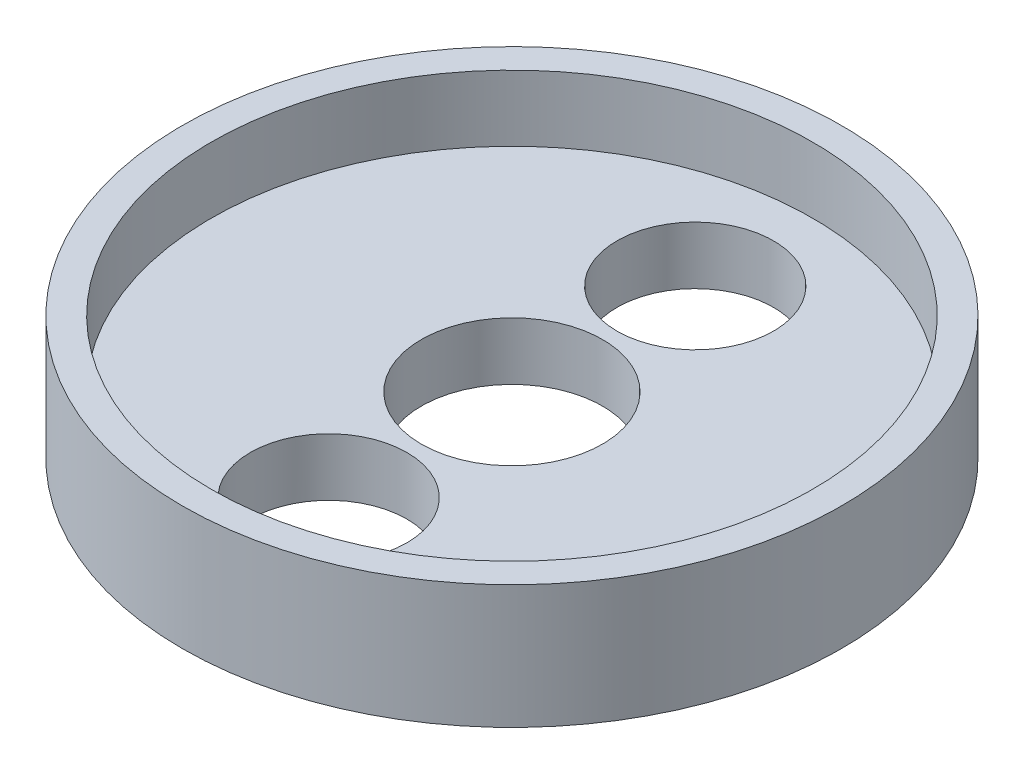
ISO-10303-21;
HEADER;
FILE_DESCRIPTION(('STEP AP214'),'2;1');
FILE_NAME('part.step','',(''),(''),'','','');
FILE_SCHEMA(('AUTOMOTIVE_DESIGN { 1 0 10303 214 1 1 1 1 }'));
ENDSEC;
DATA;
#1=APPLICATION_CONTEXT('core data for automotive mechanical design processes');
#2=APPLICATION_PROTOCOL_DEFINITION('international standard','automotive_design',2000,#1);
#3=PRODUCT_CONTEXT('',#1,'mechanical');
#4=PRODUCT('Part','Part','',(#3));
#5=PRODUCT_RELATED_PRODUCT_CATEGORY('part','',(#4));
#6=PRODUCT_DEFINITION_FORMATION('','',#4);
#7=PRODUCT_DEFINITION_CONTEXT('part definition',#1,'design');
#8=PRODUCT_DEFINITION('design','',#6,#7);
#9=PRODUCT_DEFINITION_SHAPE('','',#8);
#10=(LENGTH_UNIT() NAMED_UNIT(*) SI_UNIT(.MILLI.,.METRE.));
#11=(NAMED_UNIT(*) PLANE_ANGLE_UNIT() SI_UNIT($,.RADIAN.));
#12=(NAMED_UNIT(*) SI_UNIT($,.STERADIAN.) SOLID_ANGLE_UNIT());
#13=UNCERTAINTY_MEASURE_WITH_UNIT(LENGTH_MEASURE(1.E-05),#10,'distance_accuracy_value','');
#14=(GEOMETRIC_REPRESENTATION_CONTEXT(3) GLOBAL_UNCERTAINTY_ASSIGNED_CONTEXT((#13)) GLOBAL_UNIT_ASSIGNED_CONTEXT((#10,
#11,#12)) REPRESENTATION_CONTEXT('',''));
#15=CARTESIAN_POINT('',(0.,0.,0.));
#16=DIRECTION('',(0.,0.,1.));
#17=DIRECTION('',(1.,0.,0.));
#18=AXIS2_PLACEMENT_3D('',#15,#16,#17);
#19=CARTESIAN_POINT('',(0.,7.5,-11.125));
#20=DIRECTION('',(0.,-1.,0.));
#21=DIRECTION('',(0.,0.,-1.));
#22=AXIS2_PLACEMENT_3D('',#19,#20,#21);
#23=CYLINDRICAL_SURFACE('',#22,4.75);
#24=CARTESIAN_POINT('',(0.,0.,-11.125));
#25=DIRECTION('',(0.,1.,0.));
#26=DIRECTION('',(0.,0.,1.));
#27=AXIS2_PLACEMENT_3D('',#24,#25,#26);
#28=CIRCLE('',#27,4.75);
#29=CARTESIAN_POINT('',(0.,0.,-6.375));
#30=VERTEX_POINT('',#29);
#31=EDGE_CURVE('E58',#30,#30,#28,.T.);
#32=ORIENTED_EDGE('',*,*,#31,.F.);
#33=EDGE_LOOP('',(#32));
#34=FACE_BOUND('',#33,.T.);
#35=CARTESIAN_POINT('',(0.,3.5,-11.125));
#36=DIRECTION('',(0.,1.,0.));
#37=DIRECTION('',(0.,0.,1.));
#38=AXIS2_PLACEMENT_3D('',#35,#36,#37);
#39=CIRCLE('',#38,4.75);
#40=CARTESIAN_POINT('',(0.,3.5,-6.375));
#41=VERTEX_POINT('',#40);
#42=EDGE_CURVE('E71',#41,#41,#39,.T.);
#43=ORIENTED_EDGE('',*,*,#42,.T.);
#44=EDGE_LOOP('',(#43));
#45=FACE_BOUND('',#44,.T.);
#46=ADVANCED_FACE('F43',(#34,#45),#23,.F.);
#47=CARTESIAN_POINT('',(0.,7.5,0.));
#48=DIRECTION('',(0.,-1.,0.));
#49=DIRECTION('',(0.,0.,-1.));
#50=AXIS2_PLACEMENT_3D('',#47,#48,#49);
#51=CYLINDRICAL_SURFACE('',#50,5.5);
#52=CARTESIAN_POINT('',(0.,0.,0.));
#53=DIRECTION('',(0.,1.,0.));
#54=DIRECTION('',(0.,0.,1.));
#55=AXIS2_PLACEMENT_3D('',#52,#53,#54);
#56=CIRCLE('',#55,5.5);
#57=CARTESIAN_POINT('',(0.,0.,5.5));
#58=VERTEX_POINT('',#57);
#59=EDGE_CURVE('E63',#58,#58,#56,.T.);
#60=ORIENTED_EDGE('',*,*,#59,.F.);
#61=EDGE_LOOP('',(#60));
#62=FACE_BOUND('',#61,.T.);
#63=CARTESIAN_POINT('',(0.,3.5,0.));
#64=DIRECTION('',(0.,1.,0.));
#65=DIRECTION('',(0.,0.,1.));
#66=AXIS2_PLACEMENT_3D('',#63,#64,#65);
#67=CIRCLE('',#66,5.5);
#68=CARTESIAN_POINT('',(0.,3.5,5.5));
#69=VERTEX_POINT('',#68);
#70=EDGE_CURVE('E75',#69,#69,#67,.T.);
#71=ORIENTED_EDGE('',*,*,#70,.T.);
#72=EDGE_LOOP('',(#71));
#73=FACE_BOUND('',#72,.T.);
#74=ADVANCED_FACE('F107',(#62,#73),#51,.F.);
#75=CARTESIAN_POINT('',(0.,7.5,11.125));
#76=DIRECTION('',(0.,-1.,0.));
#77=DIRECTION('',(0.,0.,-1.));
#78=AXIS2_PLACEMENT_3D('',#75,#76,#77);
#79=CYLINDRICAL_SURFACE('',#78,4.75);
#80=CARTESIAN_POINT('',(0.,0.,11.125));
#81=DIRECTION('',(0.,1.,0.));
#82=DIRECTION('',(0.,0.,-1.));
#83=AXIS2_PLACEMENT_3D('',#80,#81,#82);
#84=CIRCLE('',#83,4.75);
#85=CARTESIAN_POINT('',(0.,0.,6.375));
#86=VERTEX_POINT('',#85);
#87=EDGE_CURVE('E67',#86,#86,#84,.T.);
#88=ORIENTED_EDGE('',*,*,#87,.F.);
#89=EDGE_LOOP('',(#88));
#90=FACE_BOUND('',#89,.T.);
#91=CARTESIAN_POINT('',(0.,3.5,11.125));
#92=DIRECTION('',(0.,1.,0.));
#93=DIRECTION('',(0.,0.,1.));
#94=AXIS2_PLACEMENT_3D('',#91,#92,#93);
#95=CIRCLE('',#94,4.75);
#96=CARTESIAN_POINT('',(0.,3.5,15.875));
#97=VERTEX_POINT('',#96);
#98=EDGE_CURVE('E47',#97,#97,#95,.T.);
#99=ORIENTED_EDGE('',*,*,#98,.T.);
#100=EDGE_LOOP('',(#99));
#101=FACE_BOUND('',#100,.T.);
#102=ADVANCED_FACE('F92',(#90,#101),#79,.F.);
#103=CARTESIAN_POINT('',(0.,7.5,0.));
#104=DIRECTION('',(0.,1.,0.));
#105=DIRECTION('',(0.,0.,1.));
#106=AXIS2_PLACEMENT_3D('',#103,#104,#105);
#107=PLANE('',#106);
#108=CARTESIAN_POINT('',(0.,7.5,0.));
#109=DIRECTION('',(0.,1.,0.));
#110=DIRECTION('',(0.,0.,1.));
#111=AXIS2_PLACEMENT_3D('',#108,#109,#110);
#112=CIRCLE('',#111,18.25);
#113=CARTESIAN_POINT('',(0.,7.5,18.25));
#114=VERTEX_POINT('',#113);
#115=EDGE_CURVE('E79',#114,#114,#112,.T.);
#116=ORIENTED_EDGE('',*,*,#115,.F.);
#117=EDGE_LOOP('',(#116));
#118=FACE_BOUND('',#117,.T.);
#119=CARTESIAN_POINT('',(0.,7.5,0.));
#120=DIRECTION('',(0.,1.,0.));
#121=DIRECTION('',(0.,0.,1.));
#122=AXIS2_PLACEMENT_3D('',#119,#120,#121);
#123=CIRCLE('',#122,20.);
#124=CARTESIAN_POINT('',(0.,7.5,20.));
#125=VERTEX_POINT('',#124);
#126=EDGE_CURVE('E10',#125,#125,#123,.T.);
#127=ORIENTED_EDGE('',*,*,#126,.T.);
#128=EDGE_LOOP('',(#127));
#129=FACE_BOUND('',#128,.T.);
#130=ADVANCED_FACE('F120',(#118,#129),#107,.T.);
#131=CARTESIAN_POINT('',(0.,0.,0.));
#132=DIRECTION('',(0.,1.,0.));
#133=DIRECTION('',(0.,0.,1.));
#134=AXIS2_PLACEMENT_3D('',#131,#132,#133);
#135=PLANE('',#134);
#136=CARTESIAN_POINT('',(0.,0.,0.));
#137=DIRECTION('',(0.,1.,0.));
#138=DIRECTION('',(0.,0.,1.));
#139=AXIS2_PLACEMENT_3D('',#136,#137,#138);
#140=CIRCLE('',#139,20.);
#141=CARTESIAN_POINT('',(0.,0.,20.));
#142=VERTEX_POINT('',#141);
#143=EDGE_CURVE('E52',#142,#142,#140,.T.);
#144=ORIENTED_EDGE('',*,*,#143,.F.);
#145=EDGE_LOOP('',(#144));
#146=FACE_BOUND('',#145,.T.);
#147=ORIENTED_EDGE('',*,*,#31,.T.);
#148=EDGE_LOOP('',(#147));
#149=FACE_BOUND('',#148,.T.);
#150=ORIENTED_EDGE('',*,*,#59,.T.);
#151=EDGE_LOOP('',(#150));
#152=FACE_BOUND('',#151,.T.);
#153=ORIENTED_EDGE('',*,*,#87,.T.);
#154=EDGE_LOOP('',(#153));
#155=FACE_BOUND('',#154,.T.);
#156=ADVANCED_FACE('F122',(#146,#149,#152,#155),#135,.F.);
#157=CARTESIAN_POINT('',(0.,7.5,0.));
#158=DIRECTION('',(0.,-1.,0.));
#159=DIRECTION('',(0.,0.,-1.));
#160=AXIS2_PLACEMENT_3D('',#157,#158,#159);
#161=CYLINDRICAL_SURFACE('',#160,20.);
#162=ORIENTED_EDGE('',*,*,#126,.F.);
#163=EDGE_LOOP('',(#162));
#164=FACE_BOUND('',#163,.T.);
#165=ORIENTED_EDGE('',*,*,#143,.T.);
#166=EDGE_LOOP('',(#165));
#167=FACE_BOUND('',#166,.T.);
#168=ADVANCED_FACE('F45',(#164,#167),#161,.T.);
#169=CARTESIAN_POINT('',(0.,3.5,0.));
#170=DIRECTION('',(0.,1.,0.));
#171=DIRECTION('',(0.,0.,1.));
#172=AXIS2_PLACEMENT_3D('',#169,#170,#171);
#173=CYLINDRICAL_SURFACE('',#172,18.25);
#174=CARTESIAN_POINT('',(0.,3.5,0.));
#175=DIRECTION('',(0.,1.,0.));
#176=DIRECTION('',(0.,0.,1.));
#177=AXIS2_PLACEMENT_3D('',#174,#175,#176);
#178=CIRCLE('',#177,18.25);
#179=CARTESIAN_POINT('',(0.,3.5,18.25));
#180=VERTEX_POINT('',#179);
#181=EDGE_CURVE('E83',#180,#180,#178,.T.);
#182=ORIENTED_EDGE('',*,*,#181,.F.);
#183=EDGE_LOOP('',(#182));
#184=FACE_BOUND('',#183,.T.);
#185=ORIENTED_EDGE('',*,*,#115,.T.);
#186=EDGE_LOOP('',(#185));
#187=FACE_BOUND('',#186,.T.);
#188=ADVANCED_FACE('F96',(#184,#187),#173,.F.);
#189=CARTESIAN_POINT('',(0.,3.5,0.));
#190=DIRECTION('',(0.,1.,0.));
#191=DIRECTION('',(0.,0.,1.));
#192=AXIS2_PLACEMENT_3D('',#189,#190,#191);
#193=PLANE('',#192);
#194=ORIENTED_EDGE('',*,*,#42,.F.);
#195=EDGE_LOOP('',(#194));
#196=FACE_BOUND('',#195,.T.);
#197=ORIENTED_EDGE('',*,*,#70,.F.);
#198=EDGE_LOOP('',(#197));
#199=FACE_BOUND('',#198,.T.);
#200=ORIENTED_EDGE('',*,*,#98,.F.);
#201=EDGE_LOOP('',(#200));
#202=FACE_BOUND('',#201,.T.);
#203=ORIENTED_EDGE('',*,*,#181,.T.);
#204=EDGE_LOOP('',(#203));
#205=FACE_BOUND('',#204,.T.);
#206=ADVANCED_FACE('F94',(#196,#199,#202,#205),#193,.T.);
#207=CLOSED_SHELL('',(#46,#74,#102,#130,#156,#168,#188,#206));
#208=MANIFOLD_SOLID_BREP('B2',#207);
#209=ADVANCED_BREP_SHAPE_REPRESENTATION('',(#18,#208),#14);
#210=SHAPE_DEFINITION_REPRESENTATION(#9,#209);
ENDSEC;
END-ISO-10303-21;
